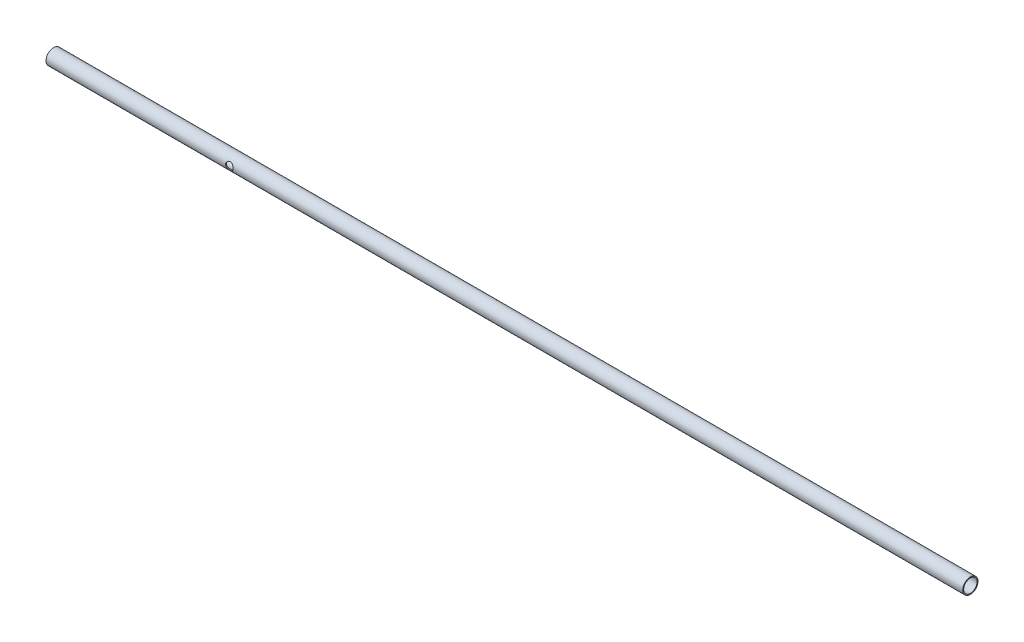
ISO-10303-21;
HEADER;
FILE_DESCRIPTION(('STEP AP214'),'2;1');
FILE_NAME('part.step','',(''),(''),'','','');
FILE_SCHEMA(('AUTOMOTIVE_DESIGN { 1 0 10303 214 1 1 1 1 }'));
ENDSEC;
DATA;
#1=APPLICATION_CONTEXT('core data for automotive mechanical design processes');
#2=APPLICATION_PROTOCOL_DEFINITION('international standard','automotive_design',2000,#1);
#3=PRODUCT_CONTEXT('',#1,'mechanical');
#4=PRODUCT('Part','Part','',(#3));
#5=PRODUCT_RELATED_PRODUCT_CATEGORY('part','',(#4));
#6=PRODUCT_DEFINITION_FORMATION('','',#4);
#7=PRODUCT_DEFINITION_CONTEXT('part definition',#1,'design');
#8=PRODUCT_DEFINITION('design','',#6,#7);
#9=PRODUCT_DEFINITION_SHAPE('','',#8);
#10=(LENGTH_UNIT() NAMED_UNIT(*) SI_UNIT(.MILLI.,.METRE.));
#11=(NAMED_UNIT(*) PLANE_ANGLE_UNIT() SI_UNIT($,.RADIAN.));
#12=(NAMED_UNIT(*) SI_UNIT($,.STERADIAN.) SOLID_ANGLE_UNIT());
#13=UNCERTAINTY_MEASURE_WITH_UNIT(LENGTH_MEASURE(1.E-05),#10,'distance_accuracy_value','');
#14=(GEOMETRIC_REPRESENTATION_CONTEXT(3) GLOBAL_UNCERTAINTY_ASSIGNED_CONTEXT((#13)) GLOBAL_UNIT_ASSIGNED_CONTEXT((#10,
#11,#12)) REPRESENTATION_CONTEXT('',''));
#15=CARTESIAN_POINT('',(0.,0.,0.));
#16=DIRECTION('',(0.,0.,1.));
#17=DIRECTION('',(1.,0.,0.));
#18=AXIS2_PLACEMENT_3D('',#15,#16,#17);
#19=CARTESIAN_POINT('',(762.,0.,0.));
#20=DIRECTION('',(-1.,0.,0.));
#21=DIRECTION('',(0.,0.,1.));
#22=AXIS2_PLACEMENT_3D('',#19,#20,#21);
#23=CYLINDRICAL_SURFACE('',#22,5.55625);
#24=CARTESIAN_POINT('',(155.575,0.,5.55625));
#25=CARTESIAN_POINT('',(155.574998926531,-0.0818955941599756,5.55624907581584));
#26=CARTESIAN_POINT('',(155.571824067391,-0.163820161962045,5.55443281108308));
#27=CARTESIAN_POINT('',(155.559175768369,-0.327037355043641,5.54722090257978));
#28=CARTESIAN_POINT('',(155.549698390611,-0.408329553065295,5.54182302098445));
#29=CARTESIAN_POINT('',(155.511910812145,-0.650622102256116,5.5203990087222));
#30=CARTESIAN_POINT('',(155.474245541173,-0.80982538586103,5.49914297555635));
#31=CARTESIAN_POINT('',(155.376087990543,-1.11785820461216,5.44488242018831));
#32=CARTESIAN_POINT('',(155.315704268554,-1.26673314751551,5.411933811553));
#33=CARTESIAN_POINT('',(155.174458133238,-1.55187499165095,5.33716403008081));
#34=CARTESIAN_POINT('',(155.093601425992,-1.6881453915039,5.2953453299769));
#35=CARTESIAN_POINT('',(154.907161283183,-1.95530059358337,5.20289527914253));
#36=CARTESIAN_POINT('',(154.800213520353,-2.08508514206389,5.15184553225058));
#37=CARTESIAN_POINT('',(154.567640223396,-2.32594787173815,5.04768603043921));
#38=CARTESIAN_POINT('',(154.441992787084,-2.43700378701571,4.99457391459942));
#39=CARTESIAN_POINT('',(154.159431933324,-2.64944920047313,4.8854969482544));
#40=CARTESIAN_POINT('',(154.000604609122,-2.74847656276639,4.82984935456824));
#41=CARTESIAN_POINT('',(153.665316443463,-2.91800355087442,4.72936919022188));
#42=CARTESIAN_POINT('',(153.488882806534,-2.98854636400856,4.68452028894636));
#43=CARTESIAN_POINT('',(153.163357051193,-3.08545461145922,4.62108929124667));
#44=CARTESIAN_POINT('',(153.016852470082,-3.11814114723426,4.59889106955501));
#45=CARTESIAN_POINT('',(152.719326045751,-3.16246948380968,4.56852875723374));
#46=CARTESIAN_POINT('',(152.568309221809,-3.17413384351834,4.56034962317601));
#47=CARTESIAN_POINT('',(152.265896432808,-3.17577403197462,4.55920772489263));
#48=CARTESIAN_POINT('',(152.114500231589,-3.16572024131077,4.56626574122337));
#49=CARTESIAN_POINT('',(151.815954788927,-3.12446191586135,4.59458927573536));
#50=CARTESIAN_POINT('',(151.668808542239,-3.09324282850273,4.61586456911201));
#51=CARTESIAN_POINT('',(151.382944363953,-3.01135644101228,4.66969003462478));
#52=CARTESIAN_POINT('',(151.24419605948,-2.96076476253733,4.70219631853634));
#53=CARTESIAN_POINT('',(150.976727329374,-2.84189530470377,4.77497585502529));
#54=CARTESIAN_POINT('',(150.848010765025,-2.77361075854551,4.81525207777826));
#55=CARTESIAN_POINT('',(150.582354573764,-2.60863765544364,4.90684883138714));
#56=CARTESIAN_POINT('',(150.447402696464,-2.50915089811192,4.95890491410423));
#57=CARTESIAN_POINT('',(150.194832474611,-2.29037946607627,5.06367781867473));
#58=CARTESIAN_POINT('',(150.077229068045,-2.17107791546503,5.11639516802952));
#59=CARTESIAN_POINT('',(149.849150565451,-1.89963078069525,5.22368276275293));
#60=CARTESIAN_POINT('',(149.741012737362,-1.74529204206063,5.27778024163388));
#61=CARTESIAN_POINT('',(149.599824535563,-1.49953429391839,5.35076364254592));
#62=CARTESIAN_POINT('',(149.556251835078,-1.41520396661186,5.37373843540262));
#63=CARTESIAN_POINT('',(149.476580318609,-1.24229016367803,5.41632093538279));
#64=CARTESIAN_POINT('',(149.440476979625,-1.15370930219605,5.43593067894543));
#65=CARTESIAN_POINT('',(149.37843137581,-0.979149226404748,5.46996726070146));
#66=CARTESIAN_POINT('',(149.351962016666,-0.893408297139817,5.48465733744817));
#67=CARTESIAN_POINT('',(149.306291136261,-0.719491473557527,5.51016919979274));
#68=CARTESIAN_POINT('',(149.287085698996,-0.631316918806,5.52099306950051));
#69=CARTESIAN_POINT('',(149.256227517957,-0.453289236793965,5.53845021519626));
#70=CARTESIAN_POINT('',(149.244570466377,-0.363437097096635,5.54508588130556));
#71=CARTESIAN_POINT('',(149.228974316859,-0.18288184555419,5.55397677543962));
#72=CARTESIAN_POINT('',(149.225034354981,-0.0921788301083774,5.55623249380579));
#73=CARTESIAN_POINT('',(149.224940575059,0.157883389356822,5.55628022640776));
#74=CARTESIAN_POINT('',(149.23691720857,0.317344998198778,5.54941286968833));
#75=CARTESIAN_POINT('',(149.284368061535,0.631465490319336,5.52250723980255));
#76=CARTESIAN_POINT('',(149.319842683816,0.786124291215653,5.50246874084292));
#77=CARTESIAN_POINT('',(149.41214327562,1.08516086642184,5.45134111697274));
#78=CARTESIAN_POINT('',(149.468746574187,1.22962780223145,5.42036741434039));
#79=CARTESIAN_POINT('',(149.601262101228,1.50710372184121,5.34986734792423));
#80=CARTESIAN_POINT('',(149.677178978716,1.64010993657146,5.31033892525712));
#81=CARTESIAN_POINT('',(149.855069089879,1.90580893125523,5.22124720070143));
#82=CARTESIAN_POINT('',(149.958931980948,2.03702802690858,5.17106764970695));
#83=CARTESIAN_POINT('',(150.185376605381,2.28119354516736,5.06810315743418));
#84=CARTESIAN_POINT('',(150.307979755456,2.39411875311965,5.01531528262758));
#85=CARTESIAN_POINT('',(150.584539016428,2.61132200246269,4.90604449658573));
#86=CARTESIAN_POINT('',(150.740466870392,2.71323094960685,4.84980610457088));
#87=CARTESIAN_POINT('',(151.070237974749,2.88914486319019,4.74712264263613));
#88=CARTESIAN_POINT('',(151.24405702122,2.96318691333941,4.70066459414225));
#89=CARTESIAN_POINT('',(151.566935982109,3.06740098122904,4.6331383302622));
#90=CARTESIAN_POINT('',(151.713368929661,3.10356175997214,4.60876817556992));
#91=CARTESIAN_POINT('',(152.011434121448,3.15474884627865,4.57388963837463));
#92=CARTESIAN_POINT('',(152.163060247719,3.16979920190414,4.56336548396887));
#93=CARTESIAN_POINT('',(152.467504897259,3.17793991689548,4.55770157850964));
#94=CARTESIAN_POINT('',(152.620325204973,3.1709860640568,4.56259280089711));
#95=CARTESIAN_POINT('',(152.922251226492,3.13544559562322,4.58708347418708));
#96=CARTESIAN_POINT('',(153.071354529254,3.10684529774062,4.60669222768318));
#97=CARTESIAN_POINT('',(153.35944631826,3.03017306372616,4.65746794790967));
#98=CARTESIAN_POINT('',(153.498565176745,2.98244659231772,4.68842906157739));
#99=CARTESIAN_POINT('',(153.767153561468,2.86928230801177,4.75852415820999));
#100=CARTESIAN_POINT('',(153.896619506935,2.80383796390924,4.79766115377084));
#101=CARTESIAN_POINT('',(154.163463804069,2.64546009240967,4.88701592988045));
#102=CARTESIAN_POINT('',(154.298990698547,2.54984541132299,4.93801199192518));
#103=CARTESIAN_POINT('',(154.55337644142,2.33900114096609,5.0413084104878));
#104=CARTESIAN_POINT('',(154.672220665025,2.22375453492584,5.09360986465359));
#105=CARTESIAN_POINT('',(154.904854117792,1.95984147229067,5.20131375110007));
#106=CARTESIAN_POINT('',(155.016172899927,1.80880073398902,5.25629186018428));
#107=CARTESIAN_POINT('',(155.211554959259,1.48699512556188,5.35621896274463));
#108=CARTESIAN_POINT('',(155.295633496605,1.31624137176335,5.4011735670322));
#109=CARTESIAN_POINT('',(155.420407388705,0.991166423649484,5.46918006252603));
#110=CARTESIAN_POINT('',(155.466158009973,0.839320539730634,5.49470498088928));
#111=CARTESIAN_POINT('',(155.517469737035,0.606888610591515,5.52356063704361));
#112=CARTESIAN_POINT('',(155.531683173028,0.528702900136776,5.53160437864514));
#113=CARTESIAN_POINT('',(155.55422253262,0.371235695131216,5.54439520584482));
#114=CARTESIAN_POINT('',(155.56255185842,0.291954860865718,5.54914419644411));
#115=CARTESIAN_POINT('',(155.5702553032,0.177095960863012,5.55353988158591));
#116=CARTESIAN_POINT('',(155.572033733516,0.141711520207131,5.55455543324547));
#117=CARTESIAN_POINT('',(155.57440637634,0.070886532598535,5.55591072790224));
#118=CARTESIAN_POINT('',(155.575000464618,0.0354459801502636,5.55625040000459));
#119=CARTESIAN_POINT('',(155.575,0.,5.55625));
#120=B_SPLINE_CURVE_WITH_KNOTS('',3,(#24,#25,#26,#27,#28,#29,#30,#31,#32,#33,#34,#35,#36,#37,
#38,#39,#40,#41,#42,#43,#44,#45,#46,#47,#48,#49,#50,#51,#52,#53,#54,#55,#56,#57,#58,#59,#60,#61,
#62,#63,#64,#65,#66,#67,#68,#69,#70,#71,#72,#73,#74,#75,#76,#77,#78,#79,#80,#81,#82,#83,#84,#85,
#86,#87,#88,#89,#90,#91,#92,#93,#94,#95,#96,#97,#98,#99,#100,#101,#102,#103,#104,#105,#106,#107,
#108,#109,#110,#111,#112,#113,#114,#115,#116,#117,#118,#119),.UNSPECIFIED.,.T.,.F.,(4,2,2,2,2,2,
2,2,2,2,2,2,2,2,2,2,2,2,2,2,2,2,2,2,2,2,2,2,2,2,2,2,2,2,2,2,2,2,2,2,2,2,2,2,2,2,2,4),(0.,
0.245646832212795,0.491447291372721,0.983678423126057,1.47358675335211,1.96335868993719,
2.4885128268266,3.01428696851078,3.59720022567377,4.17922634049297,4.63247750159198,
5.08524198836938,5.5386243492817,5.99231875780586,6.44425991494684,6.89637417692834,
7.42094037865374,7.94595565682196,8.530764907221,8.82340086174349,9.11585909131531,
9.38825774698068,9.66050934157344,9.932605426989,10.2046710491017,10.6822657626637,
11.15986866386,11.6325741323411,12.1053934946558,12.6274281634711,13.1500639462101,
13.7309893869542,14.3111390079833,14.7675443158486,15.2234292835174,15.6802308244103,
16.1373213418615,16.5865031747209,17.0358508120525,17.5543917064549,18.0733843758825,
18.6569764276864,19.2402409801107,19.7198141559177,19.9591920668056,20.1984314555149,
20.3047409542194,20.4110616034301),.UNSPECIFIED.);
#121=CARTESIAN_POINT('',(155.575,0.,5.55625));
#122=VERTEX_POINT('',#121);
#123=EDGE_CURVE('E78',#122,#122,#120,.T.);
#124=ORIENTED_EDGE('',*,*,#123,.F.);
#125=EDGE_LOOP('',(#124));
#126=FACE_BOUND('',#125,.T.);
#127=CARTESIAN_POINT('',(155.575,0.,-5.55625));
#128=CARTESIAN_POINT('',(155.574998926531,0.0818955941599734,-5.55624907581584));
#129=CARTESIAN_POINT('',(155.571824067391,0.16382016196204,-5.55443281108308));
#130=CARTESIAN_POINT('',(155.559175768369,0.327037355043635,-5.54722090257978));
#131=CARTESIAN_POINT('',(155.549698390611,0.40832955306529,-5.54182302098445));
#132=CARTESIAN_POINT('',(155.511910812145,0.650622102256113,-5.5203990087222));
#133=CARTESIAN_POINT('',(155.474245541173,0.809825385861029,-5.49914297555635));
#134=CARTESIAN_POINT('',(155.376087990543,1.11785820461216,-5.44488242018831));
#135=CARTESIAN_POINT('',(155.315704268554,1.26673314751551,-5.411933811553));
#136=CARTESIAN_POINT('',(155.174458133238,1.55187499165095,-5.33716403008081));
#137=CARTESIAN_POINT('',(155.093601425992,1.6881453915039,-5.2953453299769));
#138=CARTESIAN_POINT('',(154.907161283183,1.95530059358337,-5.20289527914253));
#139=CARTESIAN_POINT('',(154.800213520353,2.08508514206389,-5.15184553225058));
#140=CARTESIAN_POINT('',(154.567640223396,2.32594787173815,-5.04768603043921));
#141=CARTESIAN_POINT('',(154.441992787084,2.43700378701571,-4.99457391459942));
#142=CARTESIAN_POINT('',(154.159431933324,2.64944920047313,-4.8854969482544));
#143=CARTESIAN_POINT('',(154.000604609122,2.74847656276639,-4.82984935456824));
#144=CARTESIAN_POINT('',(153.665316443463,2.91800355087442,-4.72936919022188));
#145=CARTESIAN_POINT('',(153.488882806534,2.98854636400856,-4.68452028894636));
#146=CARTESIAN_POINT('',(153.163357051193,3.08545461145922,-4.62108929124667));
#147=CARTESIAN_POINT('',(153.016852470082,3.11814114723426,-4.59889106955501));
#148=CARTESIAN_POINT('',(152.719326045751,3.16246948380968,-4.56852875723374));
#149=CARTESIAN_POINT('',(152.568309221809,3.17413384351834,-4.56034962317601));
#150=CARTESIAN_POINT('',(152.265896432808,3.17577403197462,-4.55920772489263));
#151=CARTESIAN_POINT('',(152.114500231589,3.16572024131078,-4.56626574122337));
#152=CARTESIAN_POINT('',(151.815954788927,3.12446191586135,-4.59458927573536));
#153=CARTESIAN_POINT('',(151.668808542239,3.09324282850273,-4.61586456911201));
#154=CARTESIAN_POINT('',(151.382944363953,3.01135644101229,-4.66969003462478));
#155=CARTESIAN_POINT('',(151.24419605948,2.96076476253734,-4.70219631853634));
#156=CARTESIAN_POINT('',(150.976727329374,2.84189530470378,-4.77497585502529));
#157=CARTESIAN_POINT('',(150.848010765025,2.77361075854551,-4.81525207777826));
#158=CARTESIAN_POINT('',(150.582354573764,2.60863765544364,-4.90684883138713));
#159=CARTESIAN_POINT('',(150.447402696464,2.50915089811194,-4.95890491410422));
#160=CARTESIAN_POINT('',(150.194832474611,2.29037946607629,-5.06367781867472));
#161=CARTESIAN_POINT('',(150.077229068045,2.17107791546504,-5.11639516802951));
#162=CARTESIAN_POINT('',(149.849150565451,1.89963078069525,-5.22368276275293));
#163=CARTESIAN_POINT('',(149.741012737362,1.74529204206063,-5.27778024163388));
#164=CARTESIAN_POINT('',(149.599824535563,1.49953429391839,-5.35076364254592));
#165=CARTESIAN_POINT('',(149.556251835078,1.41520396661186,-5.37373843540262));
#166=CARTESIAN_POINT('',(149.476580318609,1.24229016367803,-5.41632093538279));
#167=CARTESIAN_POINT('',(149.440476979625,1.15370930219605,-5.43593067894543));
#168=CARTESIAN_POINT('',(149.37843137581,0.979149226404748,-5.46996726070146));
#169=CARTESIAN_POINT('',(149.351962016666,0.893408297139817,-5.48465733744817));
#170=CARTESIAN_POINT('',(149.306291136261,0.719491473557527,-5.51016919979274));
#171=CARTESIAN_POINT('',(149.287085698996,0.631316918806,-5.52099306950051));
#172=CARTESIAN_POINT('',(149.256227517957,0.453289236793965,-5.53845021519626));
#173=CARTESIAN_POINT('',(149.244570466377,0.363437097096635,-5.54508588130556));
#174=CARTESIAN_POINT('',(149.228974316859,0.18288184555419,-5.55397677543962));
#175=CARTESIAN_POINT('',(149.225034354981,0.0921788301083774,-5.55623249380579));
#176=CARTESIAN_POINT('',(149.224940575059,-0.157883389356822,-5.55628022640776));
#177=CARTESIAN_POINT('',(149.23691720857,-0.317344998198778,-5.54941286968833));
#178=CARTESIAN_POINT('',(149.284368061535,-0.631465490319336,-5.52250723980255));
#179=CARTESIAN_POINT('',(149.319842683816,-0.786124291215653,-5.50246874084292));
#180=CARTESIAN_POINT('',(149.41214327562,-1.08516086642184,-5.45134111697274));
#181=CARTESIAN_POINT('',(149.468746574187,-1.22962780223145,-5.42036741434039));
#182=CARTESIAN_POINT('',(149.601262101228,-1.50710372184121,-5.34986734792423));
#183=CARTESIAN_POINT('',(149.677178978716,-1.64010993657146,-5.31033892525712));
#184=CARTESIAN_POINT('',(149.855069089879,-1.90580893125523,-5.22124720070143));
#185=CARTESIAN_POINT('',(149.958931980948,-2.03702802690858,-5.17106764970695));
#186=CARTESIAN_POINT('',(150.185376605381,-2.28119354516736,-5.06810315743418));
#187=CARTESIAN_POINT('',(150.307979755456,-2.39411875311965,-5.01531528262758));
#188=CARTESIAN_POINT('',(150.584539016428,-2.61132200246269,-4.90604449658573));
#189=CARTESIAN_POINT('',(150.740466870392,-2.71323094960685,-4.84980610457088));
#190=CARTESIAN_POINT('',(151.070237974749,-2.88914486319019,-4.74712264263613));
#191=CARTESIAN_POINT('',(151.24405702122,-2.96318691333941,-4.70066459414225));
#192=CARTESIAN_POINT('',(151.566935982109,-3.06740098122904,-4.6331383302622));
#193=CARTESIAN_POINT('',(151.713368929661,-3.10356175997214,-4.60876817556992));
#194=CARTESIAN_POINT('',(152.011434121448,-3.15474884627865,-4.57388963837463));
#195=CARTESIAN_POINT('',(152.163060247719,-3.16979920190414,-4.56336548396887));
#196=CARTESIAN_POINT('',(152.467504897259,-3.17793991689548,-4.55770157850964));
#197=CARTESIAN_POINT('',(152.620325204973,-3.1709860640568,-4.56259280089711));
#198=CARTESIAN_POINT('',(152.922251226492,-3.13544559562322,-4.58708347418708));
#199=CARTESIAN_POINT('',(153.071354529254,-3.10684529774062,-4.60669222768318));
#200=CARTESIAN_POINT('',(153.35944631826,-3.03017306372616,-4.65746794790967));
#201=CARTESIAN_POINT('',(153.498565176745,-2.98244659231772,-4.68842906157739));
#202=CARTESIAN_POINT('',(153.767153561468,-2.86928230801177,-4.75852415820999));
#203=CARTESIAN_POINT('',(153.896619506935,-2.80383796390924,-4.79766115377084));
#204=CARTESIAN_POINT('',(154.163463804069,-2.64546009240967,-4.88701592988045));
#205=CARTESIAN_POINT('',(154.298990698547,-2.54984541132299,-4.93801199192518));
#206=CARTESIAN_POINT('',(154.55337644142,-2.33900114096609,-5.0413084104878));
#207=CARTESIAN_POINT('',(154.672220665025,-2.22375453492584,-5.09360986465359));
#208=CARTESIAN_POINT('',(154.904854117792,-1.95984147229067,-5.20131375110007));
#209=CARTESIAN_POINT('',(155.016172899927,-1.80880073398901,-5.25629186018428));
#210=CARTESIAN_POINT('',(155.211554959259,-1.48699512556188,-5.35621896274463));
#211=CARTESIAN_POINT('',(155.295633496605,-1.31624137176334,-5.4011735670322));
#212=CARTESIAN_POINT('',(155.420407388705,-0.991166423649489,-5.46918006252603));
#213=CARTESIAN_POINT('',(155.466158009973,-0.839320539730644,-5.49470498088928));
#214=CARTESIAN_POINT('',(155.517469737035,-0.606888610591526,-5.52356063704361));
#215=CARTESIAN_POINT('',(155.531683173028,-0.528702900136783,-5.53160437864514));
#216=CARTESIAN_POINT('',(155.55422253262,-0.371235695131218,-5.54439520584482));
#217=CARTESIAN_POINT('',(155.56255185842,-0.291954860865719,-5.54914419644411));
#218=CARTESIAN_POINT('',(155.5702553032,-0.177095960863012,-5.55353988158591));
#219=CARTESIAN_POINT('',(155.572033733516,-0.141711520207131,-5.55455543324547));
#220=CARTESIAN_POINT('',(155.57440637634,-0.070886532598536,-5.55591072790224));
#221=CARTESIAN_POINT('',(155.575000464618,-0.0354459801502641,-5.55625040000459));
#222=CARTESIAN_POINT('',(155.575,0.,-5.55625));
#223=B_SPLINE_CURVE_WITH_KNOTS('',3,(#127,#128,#129,#130,#131,#132,#133,#134,#135,#136,#137,
#138,#139,#140,#141,#142,#143,#144,#145,#146,#147,#148,#149,#150,#151,#152,#153,#154,#155,#156,
#157,#158,#159,#160,#161,#162,#163,#164,#165,#166,#167,#168,#169,#170,#171,#172,#173,#174,#175,
#176,#177,#178,#179,#180,#181,#182,#183,#184,#185,#186,#187,#188,#189,#190,#191,#192,#193,#194,
#195,#196,#197,#198,#199,#200,#201,#202,#203,#204,#205,#206,#207,#208,#209,#210,#211,#212,#213,
#214,#215,#216,#217,#218,#219,#220,#221,#222),.UNSPECIFIED.,.T.,.F.,(4,2,2,2,2,2,2,2,2,2,2,2,2,
2,2,2,2,2,2,2,2,2,2,2,2,2,2,2,2,2,2,2,2,2,2,2,2,2,2,2,2,2,2,2,2,2,2,4),(0.,0.24564683221279,
0.491447291372718,0.983678423126058,1.47358675335211,1.9633586899372,2.4885128268266,
3.01428696851078,3.59720022567377,4.17922634049297,4.63247750159198,5.08524198836938,
5.5386243492817,5.99231875780586,6.44425991494687,6.89637417692834,7.4209403786537,
7.94595565682196,8.530764907221,8.82340086174349,9.11585909131531,9.38825774698068,
9.66050934157344,9.932605426989,10.2046710491017,10.6822657626637,11.15986866386,
11.6325741323411,12.1053934946558,12.6274281634711,13.1500639462101,13.7309893869542,
14.3111390079833,14.7675443158486,15.2234292835174,15.6802308244103,16.1373213418615,
16.5865031747209,17.0358508120525,17.5543917064549,18.0733843758825,18.6569764276864,
19.2402409801107,19.7198141559177,19.9591920668056,20.1984314555149,20.3047409542194,
20.4110616034301),.UNSPECIFIED.);
#224=CARTESIAN_POINT('',(155.575,0.,-5.55625));
#225=VERTEX_POINT('',#224);
#226=EDGE_CURVE('E74',#225,#225,#223,.T.);
#227=ORIENTED_EDGE('',*,*,#226,.F.);
#228=EDGE_LOOP('',(#227));
#229=FACE_BOUND('',#228,.T.);
#230=CARTESIAN_POINT('',(762.,0.,0.));
#231=DIRECTION('',(1.,0.,0.));
#232=DIRECTION('',(0.,0.,-1.));
#233=AXIS2_PLACEMENT_3D('',#230,#231,#232);
#234=CIRCLE('',#233,5.55625);
#235=CARTESIAN_POINT('',(762.,0.,-5.55625));
#236=VERTEX_POINT('',#235);
#237=EDGE_CURVE('E51',#236,#236,#234,.T.);
#238=ORIENTED_EDGE('',*,*,#237,.T.);
#239=EDGE_LOOP('',(#238));
#240=FACE_BOUND('',#239,.T.);
#241=CARTESIAN_POINT('',(0.,0.,0.));
#242=DIRECTION('',(1.,0.,0.));
#243=DIRECTION('',(0.,0.,-1.));
#244=AXIS2_PLACEMENT_3D('',#241,#242,#243);
#245=CIRCLE('',#244,5.55625);
#246=CARTESIAN_POINT('',(0.,0.,-5.55625));
#247=VERTEX_POINT('',#246);
#248=EDGE_CURVE('E83',#247,#247,#245,.T.);
#249=ORIENTED_EDGE('',*,*,#248,.F.);
#250=EDGE_LOOP('',(#249));
#251=FACE_BOUND('',#250,.T.);
#252=ADVANCED_FACE('F33',(#126,#229,#240,#251),#23,.F.);
#253=CARTESIAN_POINT('',(762.,0.,0.));
#254=DIRECTION('',(-1.,0.,0.));
#255=DIRECTION('',(0.,0.,1.));
#256=AXIS2_PLACEMENT_3D('',#253,#254,#255);
#257=CYLINDRICAL_SURFACE('',#256,6.35);
#258=CARTESIAN_POINT('',(155.575,0.,-6.35));
#259=CARTESIAN_POINT('',(155.574999112282,0.0834969220594991,-6.34999931166444));
#260=CARTESIAN_POINT('',(155.571700125554,0.167002655580041,-6.34834758911701));
#261=CARTESIAN_POINT('',(155.55855412545,0.33337833025878,-6.34179105821715));
#262=CARTESIAN_POINT('',(155.548704263474,0.416247978955771,-6.33688483467113));
#263=CARTESIAN_POINT('',(155.509427934954,0.66318203064701,-6.31742426748325));
#264=CARTESIAN_POINT('',(155.470274922599,0.825450146761553,-6.29812827299425));
#265=CARTESIAN_POINT('',(155.368009288706,1.13965128900426,-6.2489182313574));
#266=CARTESIAN_POINT('',(155.304989780757,1.29162180811869,-6.21904547786825));
#267=CARTESIAN_POINT('',(155.157263926371,1.5826403503788,-6.15142812041637));
#268=CARTESIAN_POINT('',(155.072559289849,1.72168939123018,-6.11368413715877));
#269=CARTESIAN_POINT('',(154.878030370266,1.99234108848171,-6.03111096182982));
#270=CARTESIAN_POINT('',(154.766996422206,2.12298433900091,-5.98599127270818));
#271=CARTESIAN_POINT('',(154.525603316427,2.36467069069853,-5.89470535591056));
#272=CARTESIAN_POINT('',(154.395229570234,2.47569885601321,-5.84853836069043));
#273=CARTESIAN_POINT('',(154.106579052247,2.68368848497887,-5.75623634934464));
#274=CARTESIAN_POINT('',(153.946922468698,2.77889135161934,-5.71038146176788));
#275=CARTESIAN_POINT('',(153.695452012826,2.90019349951534,-5.64919759286363));
#276=CARTESIAN_POINT('',(153.609599938171,2.93705266116891,-5.63006420805933));
#277=CARTESIAN_POINT('',(153.434414386294,3.00322508739605,-5.59504604853268));
#278=CARTESIAN_POINT('',(153.345083001819,3.03254280972158,-5.57915935583429));
#279=CARTESIAN_POINT('',(153.168989448035,3.08174263292982,-5.55212611635049));
#280=CARTESIAN_POINT('',(153.082389205971,3.10208128111978,-5.54075429137746));
#281=CARTESIAN_POINT('',(152.907412721006,3.13545600360765,-5.52193654886444));
#282=CARTESIAN_POINT('',(152.819037446228,3.14849595237257,-5.51448854851135));
#283=CARTESIAN_POINT('',(152.641293261151,3.1670771305344,-5.50383875782919));
#284=CARTESIAN_POINT('',(152.551924982013,3.17262287599649,-5.50063441026522));
#285=CARTESIAN_POINT('',(152.373019215822,3.17614778806993,-5.49859788398609));
#286=CARTESIAN_POINT('',(152.283481745729,3.17412767659872,-5.49976528812799));
#287=CARTESIAN_POINT('',(152.037252124276,3.1581193033026,-5.50899190362733));
#288=CARTESIAN_POINT('',(151.881158270187,3.13621253452965,-5.52160857357707));
#289=CARTESIAN_POINT('',(151.575353358693,3.07003746372168,-5.55866493052824));
#290=CARTESIAN_POINT('',(151.425644350977,3.02576203854504,-5.58310838358077));
#291=CARTESIAN_POINT('',(151.132455703436,2.91531509833647,-5.64157885407237));
#292=CARTESIAN_POINT('',(150.989202390063,2.84865758129418,-5.67581583876129));
#293=CARTESIAN_POINT('',(150.715233913826,2.69570761526054,-5.75003268807633));
#294=CARTESIAN_POINT('',(150.584524420391,2.60940634674629,-5.79001512927804));
#295=CARTESIAN_POINT('',(150.32189572575,2.40685964249565,-5.87734289018611));
#296=CARTESIAN_POINT('',(150.191924615144,2.28820488335253,-5.92497898403936));
#297=CARTESIAN_POINT('',(149.952914857136,2.03058898448427,-6.01813700574905));
#298=CARTESIAN_POINT('',(149.843886213641,1.89161819563546,-6.06365791538159));
#299=CARTESIAN_POINT('',(149.64509808028,1.58913989972482,-6.1500381059768));
#300=CARTESIAN_POINT('',(149.55646851442,1.42479265164788,-6.19058274974572));
#301=CARTESIAN_POINT('',(149.408841918365,1.08098023585583,-6.25976272299952));
#302=CARTESIAN_POINT('',(149.349821358868,0.901527205073901,-6.28840750578946));
#303=CARTESIAN_POINT('',(149.267940596601,0.54853361062684,-6.32854759690358));
#304=CARTESIAN_POINT('',(149.242490327413,0.375734359385249,-6.34126679122996));
#305=CARTESIAN_POINT('',(149.22034947774,0.0278752299448309,-6.35231817716325));
#306=CARTESIAN_POINT('',(149.223645272861,-0.147183538060022,-6.3506571843613));
#307=CARTESIAN_POINT('',(149.257406235945,-0.480164686080367,-6.33384535408399));
#308=CARTESIAN_POINT('',(149.285745791475,-0.638363620564194,-6.31975005060431));
#309=CARTESIAN_POINT('',(149.36545587821,-0.947441883053003,-6.28085393924121));
#310=CARTESIAN_POINT('',(149.416828948477,-1.09832040207141,-6.25605195113515));
#311=CARTESIAN_POINT('',(149.542495130938,-1.39347133182513,-6.19709998236334));
#312=CARTESIAN_POINT('',(149.617401584111,-1.53743151047822,-6.16270299610718));
#313=CARTESIAN_POINT('',(149.787316425686,-1.81121482341041,-6.08787118465664));
#314=CARTESIAN_POINT('',(149.882333377385,-1.94103189959928,-6.0474337895468));
#315=CARTESIAN_POINT('',(150.100539350374,-2.1963624134268,-5.95973602709939));
#316=CARTESIAN_POINT('',(150.225578607112,-2.32020134681981,-5.91219559251098));
#317=CARTESIAN_POINT('',(150.49476235515,-2.54589381918875,-5.81858093231368));
#318=CARTESIAN_POINT('',(150.638919952381,-2.64773214935251,-5.77250773963547));
#319=CARTESIAN_POINT('',(150.951068601958,-2.83117262876716,-5.68487535288742));
#320=CARTESIAN_POINT('',(151.11987576951,-2.91155594998014,-5.64364281441821));
#321=CARTESIAN_POINT('',(151.47134446489,-3.04191297152939,-5.5744767953732));
#322=CARTESIAN_POINT('',(151.653987797847,-3.09192585492219,-5.54652618900869));
#323=CARTESIAN_POINT('',(152.00918995647,-3.15551086037917,-5.51057765714603));
#324=CARTESIAN_POINT('',(152.181033750407,-3.17212027309711,-5.50092192343245));
#325=CARTESIAN_POINT('',(152.525244442495,-3.17718805563876,-5.49800001145358));
#326=CARTESIAN_POINT('',(152.697611081543,-3.16565862768385,-5.50472672904441));
#327=CARTESIAN_POINT('',(153.020660103074,-3.11761548073657,-5.53205211477785));
#328=CARTESIAN_POINT('',(153.171843941731,-3.08358651207685,-5.5512682307627));
#329=CARTESIAN_POINT('',(153.466190830167,-2.99458164828806,-5.59977978302583));
#330=CARTESIAN_POINT('',(153.60935128285,-2.93959901505997,-5.62907846127336));
#331=CARTESIAN_POINT('',(153.894233699429,-2.80611544421369,-5.69685576337175));
#332=CARTESIAN_POINT('',(154.035212809366,-2.72628260503928,-5.73581889480533));
#333=CARTESIAN_POINT('',(154.302697431723,-2.54682759156581,-5.81772207082383));
#334=CARTESIAN_POINT('',(154.429195359943,-2.44719512169929,-5.86066417820131));
#335=CARTESIAN_POINT('',(154.680097524177,-2.21680287661217,-5.95192753761204));
#336=CARTESIAN_POINT('',(154.802379756413,-2.08373188558711,-6.00026839877347));
#337=CARTESIAN_POINT('',(155.023397873233,-1.79751265125243,-6.0921234557675));
#338=CARTESIAN_POINT('',(155.122121065983,-1.64435365457427,-6.13563504323043));
#339=CARTESIAN_POINT('',(155.250280266197,-1.40178715704487,-6.19391073190243));
#340=CARTESIAN_POINT('',(155.289800583681,-1.31842200030918,-6.21223173271384));
#341=CARTESIAN_POINT('',(155.361599474824,-1.1480770102167,-6.24595363475604));
#342=CARTESIAN_POINT('',(155.393881606534,-1.06109897786306,-6.26135597012704));
#343=CARTESIAN_POINT('',(155.450759345915,-0.884361322813097,-6.28875097111981));
#344=CARTESIAN_POINT('',(155.475371718138,-0.794608244970558,-6.30075106809478));
#345=CARTESIAN_POINT('',(155.51666738953,-0.612925661591565,-6.32100983571903));
#346=CARTESIAN_POINT('',(155.533355532194,-0.520997521680272,-6.32927079168361));
#347=CARTESIAN_POINT('',(155.555616284862,-0.357531347524358,-6.34032503263334));
#348=CARTESIAN_POINT('',(155.56287882125,-0.286274046488583,-6.34394670812889));
#349=CARTESIAN_POINT('',(155.572571126538,-0.143346668941341,-6.34878452045567));
#350=CARTESIAN_POINT('',(155.575000762047,-0.0716765810914227,-6.35000059089052));
#351=CARTESIAN_POINT('',(155.575,0.,-6.35));
#352=B_SPLINE_CURVE_WITH_KNOTS('',3,(#258,#259,#260,#261,#262,#263,#264,#265,#266,#267,#268,
#269,#270,#271,#272,#273,#274,#275,#276,#277,#278,#279,#280,#281,#282,#283,#284,#285,#286,#287,
#288,#289,#290,#291,#292,#293,#294,#295,#296,#297,#298,#299,#300,#301,#302,#303,#304,#305,#306,
#307,#308,#309,#310,#311,#312,#313,#314,#315,#316,#317,#318,#319,#320,#321,#322,#323,#324,#325,
#326,#327,#328,#329,#330,#331,#332,#333,#334,#335,#336,#337,#338,#339,#340,#341,#342,#343,#344,
#345,#346,#347,#348,#349,#350,#351),.UNSPECIFIED.,.T.,.F.,(4,2,2,2,2,2,2,2,2,2,2,2,2,2,2,2,2,2,
2,2,2,2,2,2,2,2,2,2,2,2,2,2,2,2,2,2,2,2,2,2,2,2,2,2,2,2,4),(0.,0.250415612102678,
0.500940186864015,1.00234854488129,1.50182051324264,2.00125310940106,2.53090025348452,
3.06094897410616,3.63210298373098,3.91787290005988,4.20347350732848,4.47213270490101,
4.74064915090146,5.00900371453887,5.27733267302577,5.74927594687736,6.22136960256846,
6.70445970327763,7.1877671279402,7.73235646527881,8.27720530143646,8.84735553323666,
9.41705196489302,9.93956405039338,10.4618285011675,10.9436138594975,11.4254523397102,
11.9210677568139,12.4168946391879,12.9614122158799,13.5063050164601,14.077585736555,
14.6481278321882,15.1639000911418,15.6794487286237,16.1458838633214,16.6124691169503,
17.1104020806943,17.6085946442304,18.1673210354482,18.7263477502426,19.0082017078365,
19.2899168101042,19.5710117490933,19.8519346536844,20.0668939492148,20.2818591776892),.UNSPECIFIED.);
#353=CARTESIAN_POINT('',(155.575,0.,-6.35));
#354=VERTEX_POINT('',#353);
#355=EDGE_CURVE('E10',#354,#354,#352,.T.);
#356=ORIENTED_EDGE('',*,*,#355,.T.);
#357=EDGE_LOOP('',(#356));
#358=FACE_BOUND('',#357,.T.);
#359=CARTESIAN_POINT('',(155.575,0.,6.35));
#360=CARTESIAN_POINT('',(155.574999112282,-0.0834969220594991,6.34999931166444));
#361=CARTESIAN_POINT('',(155.571700125554,-0.167002655580041,6.34834758911701));
#362=CARTESIAN_POINT('',(155.55855412545,-0.33337833025878,6.34179105821715));
#363=CARTESIAN_POINT('',(155.548704263474,-0.416247978955771,6.33688483467113));
#364=CARTESIAN_POINT('',(155.509427934954,-0.66318203064701,6.31742426748325));
#365=CARTESIAN_POINT('',(155.470274922599,-0.825450146761553,6.29812827299425));
#366=CARTESIAN_POINT('',(155.368009288706,-1.13965128900426,6.2489182313574));
#367=CARTESIAN_POINT('',(155.304989780757,-1.29162180811869,6.21904547786825));
#368=CARTESIAN_POINT('',(155.157263926371,-1.5826403503788,6.15142812041637));
#369=CARTESIAN_POINT('',(155.072559289849,-1.72168939123018,6.11368413715877));
#370=CARTESIAN_POINT('',(154.878030370266,-1.99234108848171,6.03111096182982));
#371=CARTESIAN_POINT('',(154.766996422206,-2.12298433900091,5.98599127270818));
#372=CARTESIAN_POINT('',(154.525603316427,-2.36467069069853,5.89470535591056));
#373=CARTESIAN_POINT('',(154.395229570234,-2.47569885601321,5.84853836069043));
#374=CARTESIAN_POINT('',(154.106579052247,-2.68368848497887,5.75623634934464));
#375=CARTESIAN_POINT('',(153.946922468698,-2.77889135161934,5.71038146176788));
#376=CARTESIAN_POINT('',(153.695452012826,-2.90019349951534,5.64919759286363));
#377=CARTESIAN_POINT('',(153.609599938171,-2.93705266116891,5.63006420805933));
#378=CARTESIAN_POINT('',(153.434414386294,-3.00322508739605,5.59504604853268));
#379=CARTESIAN_POINT('',(153.345083001819,-3.03254280972158,5.57915935583429));
#380=CARTESIAN_POINT('',(153.168989448035,-3.08174263292982,5.55212611635049));
#381=CARTESIAN_POINT('',(153.082389205971,-3.10208128111978,5.54075429137746));
#382=CARTESIAN_POINT('',(152.907412721006,-3.13545600360765,5.52193654886444));
#383=CARTESIAN_POINT('',(152.819037446228,-3.14849595237257,5.51448854851135));
#384=CARTESIAN_POINT('',(152.641293261151,-3.1670771305344,5.50383875782919));
#385=CARTESIAN_POINT('',(152.551924982013,-3.17262287599649,5.50063441026522));
#386=CARTESIAN_POINT('',(152.373019215822,-3.17614778806993,5.49859788398609));
#387=CARTESIAN_POINT('',(152.283481745729,-3.17412767659872,5.49976528812799));
#388=CARTESIAN_POINT('',(152.037252124276,-3.1581193033026,5.50899190362733));
#389=CARTESIAN_POINT('',(151.881158270187,-3.13621253452965,5.52160857357707));
#390=CARTESIAN_POINT('',(151.575353358693,-3.07003746372168,5.55866493052824));
#391=CARTESIAN_POINT('',(151.425644350977,-3.02576203854504,5.58310838358077));
#392=CARTESIAN_POINT('',(151.132455703436,-2.91531509833647,5.64157885407237));
#393=CARTESIAN_POINT('',(150.989202390063,-2.84865758129418,5.67581583876129));
#394=CARTESIAN_POINT('',(150.715233913826,-2.69570761526054,5.75003268807633));
#395=CARTESIAN_POINT('',(150.584524420391,-2.60940634674629,5.79001512927804));
#396=CARTESIAN_POINT('',(150.32189572575,-2.40685964249565,5.87734289018611));
#397=CARTESIAN_POINT('',(150.191924615144,-2.28820488335253,5.92497898403936));
#398=CARTESIAN_POINT('',(149.952914857136,-2.03058898448427,6.01813700574905));
#399=CARTESIAN_POINT('',(149.843886213641,-1.89161819563546,6.06365791538159));
#400=CARTESIAN_POINT('',(149.64509808028,-1.58913989972482,6.1500381059768));
#401=CARTESIAN_POINT('',(149.55646851442,-1.42479265164788,6.19058274974572));
#402=CARTESIAN_POINT('',(149.408841918365,-1.08098023585583,6.25976272299952));
#403=CARTESIAN_POINT('',(149.349821358868,-0.901527205073901,6.28840750578946));
#404=CARTESIAN_POINT('',(149.267940596601,-0.54853361062684,6.32854759690358));
#405=CARTESIAN_POINT('',(149.242490327413,-0.375734359385249,6.34126679122996));
#406=CARTESIAN_POINT('',(149.22034947774,-0.0278752299448309,6.35231817716325));
#407=CARTESIAN_POINT('',(149.223645272861,0.147183538060022,6.3506571843613));
#408=CARTESIAN_POINT('',(149.257406235945,0.480164686080367,6.33384535408399));
#409=CARTESIAN_POINT('',(149.285745791475,0.638363620564194,6.31975005060431));
#410=CARTESIAN_POINT('',(149.36545587821,0.947441883053003,6.28085393924121));
#411=CARTESIAN_POINT('',(149.416828948477,1.09832040207141,6.25605195113515));
#412=CARTESIAN_POINT('',(149.542495130938,1.39347133182513,6.19709998236334));
#413=CARTESIAN_POINT('',(149.617401584111,1.53743151047822,6.16270299610718));
#414=CARTESIAN_POINT('',(149.787316425686,1.81121482341041,6.08787118465664));
#415=CARTESIAN_POINT('',(149.882333377385,1.94103189959928,6.0474337895468));
#416=CARTESIAN_POINT('',(150.100539350374,2.1963624134268,5.95973602709939));
#417=CARTESIAN_POINT('',(150.225578607112,2.32020134681981,5.91219559251098));
#418=CARTESIAN_POINT('',(150.49476235515,2.54589381918875,5.81858093231368));
#419=CARTESIAN_POINT('',(150.638919952381,2.64773214935251,5.77250773963547));
#420=CARTESIAN_POINT('',(150.951068601958,2.83117262876716,5.68487535288742));
#421=CARTESIAN_POINT('',(151.11987576951,2.91155594998014,5.64364281441821));
#422=CARTESIAN_POINT('',(151.47134446489,3.04191297152939,5.5744767953732));
#423=CARTESIAN_POINT('',(151.653987797847,3.09192585492219,5.54652618900869));
#424=CARTESIAN_POINT('',(152.00918995647,3.15551086037917,5.51057765714603));
#425=CARTESIAN_POINT('',(152.181033750407,3.17212027309711,5.50092192343245));
#426=CARTESIAN_POINT('',(152.525244442495,3.17718805563876,5.49800001145358));
#427=CARTESIAN_POINT('',(152.697611081543,3.16565862768385,5.50472672904441));
#428=CARTESIAN_POINT('',(153.020660103074,3.11761548073657,5.53205211477785));
#429=CARTESIAN_POINT('',(153.171843941731,3.08358651207685,5.5512682307627));
#430=CARTESIAN_POINT('',(153.466190830167,2.99458164828806,5.59977978302583));
#431=CARTESIAN_POINT('',(153.60935128285,2.93959901505997,5.62907846127336));
#432=CARTESIAN_POINT('',(153.894233699429,2.80611544421369,5.69685576337175));
#433=CARTESIAN_POINT('',(154.035212809366,2.72628260503928,5.73581889480533));
#434=CARTESIAN_POINT('',(154.302697431723,2.54682759156581,5.81772207082383));
#435=CARTESIAN_POINT('',(154.429195359943,2.44719512169929,5.86066417820131));
#436=CARTESIAN_POINT('',(154.680097524177,2.21680287661217,5.95192753761204));
#437=CARTESIAN_POINT('',(154.802379756413,2.08373188558711,6.00026839877347));
#438=CARTESIAN_POINT('',(155.023397873233,1.79751265125243,6.0921234557675));
#439=CARTESIAN_POINT('',(155.122121065983,1.64435365457427,6.13563504323043));
#440=CARTESIAN_POINT('',(155.250280266197,1.40178715704487,6.19391073190243));
#441=CARTESIAN_POINT('',(155.289800583681,1.31842200030918,6.21223173271384));
#442=CARTESIAN_POINT('',(155.361599474824,1.1480770102167,6.24595363475604));
#443=CARTESIAN_POINT('',(155.393881606534,1.06109897786306,6.26135597012704));
#444=CARTESIAN_POINT('',(155.450759345915,0.884361322813097,6.28875097111981));
#445=CARTESIAN_POINT('',(155.475371718138,0.794608244970558,6.30075106809478));
#446=CARTESIAN_POINT('',(155.51666738953,0.612925661591565,6.32100983571903));
#447=CARTESIAN_POINT('',(155.533355532194,0.520997521680272,6.32927079168361));
#448=CARTESIAN_POINT('',(155.555616284862,0.357531347524358,6.34032503263334));
#449=CARTESIAN_POINT('',(155.56287882125,0.286274046488583,6.34394670812889));
#450=CARTESIAN_POINT('',(155.572571126538,0.143346668941341,6.34878452045567));
#451=CARTESIAN_POINT('',(155.575000762047,0.0716765810914227,6.35000059089052));
#452=CARTESIAN_POINT('',(155.575,0.,6.35));
#453=B_SPLINE_CURVE_WITH_KNOTS('',3,(#359,#360,#361,#362,#363,#364,#365,#366,#367,#368,#369,
#370,#371,#372,#373,#374,#375,#376,#377,#378,#379,#380,#381,#382,#383,#384,#385,#386,#387,#388,
#389,#390,#391,#392,#393,#394,#395,#396,#397,#398,#399,#400,#401,#402,#403,#404,#405,#406,#407,
#408,#409,#410,#411,#412,#413,#414,#415,#416,#417,#418,#419,#420,#421,#422,#423,#424,#425,#426,
#427,#428,#429,#430,#431,#432,#433,#434,#435,#436,#437,#438,#439,#440,#441,#442,#443,#444,#445,
#446,#447,#448,#449,#450,#451,#452),.UNSPECIFIED.,.T.,.F.,(4,2,2,2,2,2,2,2,2,2,2,2,2,2,2,2,2,2,
2,2,2,2,2,2,2,2,2,2,2,2,2,2,2,2,2,2,2,2,2,2,2,2,2,2,2,2,4),(0.,0.250415612102678,
0.500940186864015,1.00234854488129,1.50182051324264,2.00125310940106,2.53090025348452,
3.06094897410616,3.63210298373098,3.91787290005988,4.20347350732848,4.47213270490101,
4.74064915090146,5.00900371453887,5.27733267302577,5.74927594687736,6.22136960256846,
6.70445970327763,7.1877671279402,7.73235646527881,8.27720530143646,8.84735553323666,
9.41705196489302,9.93956405039338,10.4618285011675,10.9436138594975,11.4254523397102,
11.9210677568139,12.4168946391879,12.9614122158799,13.5063050164601,14.077585736555,
14.6481278321882,15.1639000911418,15.6794487286237,16.1458838633214,16.6124691169503,
17.1104020806943,17.6085946442304,18.1673210354482,18.7263477502426,19.0082017078365,
19.2899168101042,19.5710117490933,19.8519346536844,20.0668939492148,20.2818591776892),.UNSPECIFIED.);
#454=CARTESIAN_POINT('',(155.575,0.,6.35));
#455=VERTEX_POINT('',#454);
#456=EDGE_CURVE('E43',#455,#455,#453,.T.);
#457=ORIENTED_EDGE('',*,*,#456,.T.);
#458=EDGE_LOOP('',(#457));
#459=FACE_BOUND('',#458,.T.);
#460=CARTESIAN_POINT('',(762.,0.,0.));
#461=DIRECTION('',(1.,0.,0.));
#462=DIRECTION('',(0.,0.,-1.));
#463=AXIS2_PLACEMENT_3D('',#460,#461,#462);
#464=CIRCLE('',#463,6.35);
#465=CARTESIAN_POINT('',(762.,0.,-6.35));
#466=VERTEX_POINT('',#465);
#467=EDGE_CURVE('E47',#466,#466,#464,.T.);
#468=ORIENTED_EDGE('',*,*,#467,.F.);
#469=EDGE_LOOP('',(#468));
#470=FACE_BOUND('',#469,.T.);
#471=CARTESIAN_POINT('',(0.,0.,0.));
#472=DIRECTION('',(1.,0.,0.));
#473=DIRECTION('',(0.,0.,-1.));
#474=AXIS2_PLACEMENT_3D('',#471,#472,#473);
#475=CIRCLE('',#474,6.35);
#476=CARTESIAN_POINT('',(0.,0.,-6.35));
#477=VERTEX_POINT('',#476);
#478=EDGE_CURVE('E56',#477,#477,#475,.T.);
#479=ORIENTED_EDGE('',*,*,#478,.T.);
#480=EDGE_LOOP('',(#479));
#481=FACE_BOUND('',#480,.T.);
#482=ADVANCED_FACE('F58',(#358,#459,#470,#481),#257,.T.);
#483=CARTESIAN_POINT('',(762.,0.,0.));
#484=DIRECTION('',(1.,0.,0.));
#485=DIRECTION('',(0.,0.,-1.));
#486=AXIS2_PLACEMENT_3D('',#483,#484,#485);
#487=PLANE('',#486);
#488=ORIENTED_EDGE('',*,*,#237,.F.);
#489=EDGE_LOOP('',(#488));
#490=FACE_BOUND('',#489,.T.);
#491=ORIENTED_EDGE('',*,*,#467,.T.);
#492=EDGE_LOOP('',(#491));
#493=FACE_BOUND('',#492,.T.);
#494=ADVANCED_FACE('F68',(#490,#493),#487,.T.);
#495=CARTESIAN_POINT('',(0.,0.,0.));
#496=DIRECTION('',(1.,0.,0.));
#497=DIRECTION('',(0.,0.,-1.));
#498=AXIS2_PLACEMENT_3D('',#495,#496,#497);
#499=PLANE('',#498);
#500=ORIENTED_EDGE('',*,*,#248,.T.);
#501=EDGE_LOOP('',(#500));
#502=FACE_BOUND('',#501,.T.);
#503=ORIENTED_EDGE('',*,*,#478,.F.);
#504=EDGE_LOOP('',(#503));
#505=FACE_BOUND('',#504,.T.);
#506=ADVANCED_FACE('F66',(#502,#505),#499,.F.);
#507=CARTESIAN_POINT('',(152.4,0.,-6.35));
#508=DIRECTION('',(0.,0.,1.));
#509=DIRECTION('',(1.,0.,0.));
#510=AXIS2_PLACEMENT_3D('',#507,#508,#509);
#511=CYLINDRICAL_SURFACE('',#510,3.175);
#512=ORIENTED_EDGE('',*,*,#123,.T.);
#513=EDGE_LOOP('',(#512));
#514=FACE_BOUND('',#513,.T.);
#515=ORIENTED_EDGE('',*,*,#456,.F.);
#516=EDGE_LOOP('',(#515));
#517=FACE_BOUND('',#516,.T.);
#518=ADVANCED_FACE('F61',(#514,#517),#511,.F.);
#519=ORIENTED_EDGE('',*,*,#226,.T.);
#520=EDGE_LOOP('',(#519));
#521=FACE_BOUND('',#520,.T.);
#522=ORIENTED_EDGE('',*,*,#355,.F.);
#523=EDGE_LOOP('',(#522));
#524=FACE_BOUND('',#523,.T.);
#525=ADVANCED_FACE('F65',(#521,#524),#511,.F.);
#526=CLOSED_SHELL('',(#252,#482,#494,#506,#518,#525));
#527=MANIFOLD_SOLID_BREP('B2',#526);
#528=ADVANCED_BREP_SHAPE_REPRESENTATION('',(#18,#527),#14);
#529=SHAPE_DEFINITION_REPRESENTATION(#9,#528);
ENDSEC;
END-ISO-10303-21;
